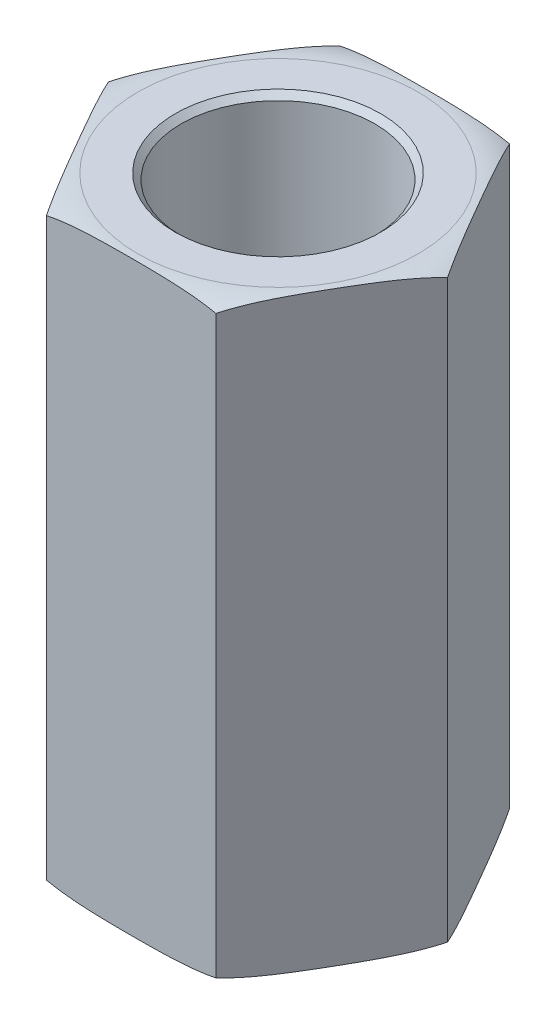
ISO-10303-21;
HEADER;
FILE_DESCRIPTION(('STEP AP214'),'2;1');
FILE_NAME('part.step','',(''),(''),'','','');
FILE_SCHEMA(('AUTOMOTIVE_DESIGN { 1 0 10303 214 1 1 1 1 }'));
ENDSEC;
DATA;
#1=APPLICATION_CONTEXT('core data for automotive mechanical design processes');
#2=APPLICATION_PROTOCOL_DEFINITION('international standard','automotive_design',2000,#1);
#3=PRODUCT_CONTEXT('',#1,'mechanical');
#4=PRODUCT('Part','Part','',(#3));
#5=PRODUCT_RELATED_PRODUCT_CATEGORY('part','',(#4));
#6=PRODUCT_DEFINITION_FORMATION('','',#4);
#7=PRODUCT_DEFINITION_CONTEXT('part definition',#1,'design');
#8=PRODUCT_DEFINITION('design','',#6,#7);
#9=PRODUCT_DEFINITION_SHAPE('','',#8);
#10=(LENGTH_UNIT() NAMED_UNIT(*) SI_UNIT(.MILLI.,.METRE.));
#11=(NAMED_UNIT(*) PLANE_ANGLE_UNIT() SI_UNIT($,.RADIAN.));
#12=(NAMED_UNIT(*) SI_UNIT($,.STERADIAN.) SOLID_ANGLE_UNIT());
#13=UNCERTAINTY_MEASURE_WITH_UNIT(LENGTH_MEASURE(1.E-05),#10,'distance_accuracy_value','');
#14=(GEOMETRIC_REPRESENTATION_CONTEXT(3) GLOBAL_UNCERTAINTY_ASSIGNED_CONTEXT((#13)) GLOBAL_UNIT_ASSIGNED_CONTEXT((#10,
#11,#12)) REPRESENTATION_CONTEXT('',''));
#15=CARTESIAN_POINT('',(0.,0.,0.));
#16=DIRECTION('',(0.,0.,1.));
#17=DIRECTION('',(1.,0.,0.));
#18=AXIS2_PLACEMENT_3D('',#15,#16,#17);
#19=CARTESIAN_POINT('',(3.66617420935412,6.35,0.));
#20=DIRECTION('',(-0.866025403784439,0.,0.5));
#21=DIRECTION('',(0.5,0.,0.866025403784439));
#22=AXIS2_PLACEMENT_3D('',#19,#20,#21);
#23=PLANE('',#22);
#24=CARTESIAN_POINT('',(3.66617420935412,6.223,0.));
#25=CARTESIAN_POINT('',(3.63753042799203,6.23493202468709,-0.0496124846400273));
#26=CARTESIAN_POINT('',(3.60875945805375,6.24555614694223,-0.0994452663561575));
#27=CARTESIAN_POINT('',(3.5510445941875,6.26452869380446,-0.199410342924434));
#28=CARTESIAN_POINT('',(3.52210079717004,6.27287829008084,-0.249542469922636));
#29=CARTESIAN_POINT('',(3.43520914920621,6.29501015084215,-0.400043218949385));
#30=CARTESIAN_POINT('',(3.37708055050429,6.30592253839952,-0.500724905273883));
#31=CARTESIAN_POINT('',(3.26070078255249,6.3225474670846,-0.70230057633948));
#32=CARTESIAN_POINT('',(3.20244972255356,6.32826351393611,-0.803194371852365));
#33=CARTESIAN_POINT('',(3.08586365366197,6.33654325238667,-1.00512736662734));
#34=CARTESIAN_POINT('',(3.02752861562773,6.3391051045623,-1.1061666163641));
#35=CARTESIAN_POINT('',(2.9113821383228,6.3424800878033,-1.30733821617637));
#36=CARTESIAN_POINT('',(2.85357078573452,6.34330898530758,-1.40747041611356));
#37=CARTESIAN_POINT('',(2.73795502274299,6.34390235146376,-1.60772279177073));
#38=CARTESIAN_POINT('',(2.68015061252641,6.34366697200316,-1.70784296716739));
#39=CARTESIAN_POINT('',(2.5645271384304,6.34193398748164,-1.90810869884931));
#40=CARTESIAN_POINT('',(2.50670807591217,6.34043597123025,-2.0082542527769));
#41=CARTESIAN_POINT('',(2.39109525560101,6.33517531674577,-2.20850153156215));
#42=CARTESIAN_POINT('',(2.33330149587797,6.33141290136093,-2.30860325976288));
#43=CARTESIAN_POINT('',(2.23849359853911,6.32198899303816,-2.47281535491257));
#44=CARTESIAN_POINT('',(2.20145192539195,6.31749057663767,-2.53697341480081));
#45=CARTESIAN_POINT('',(2.12747060706784,6.30630148199487,-2.66511281694908));
#46=CARTESIAN_POINT('',(2.09053091530161,6.2996120720916,-2.72909423990413));
#47=CARTESIAN_POINT('',(2.01669860633929,6.28339780386583,-2.85697555026699));
#48=CARTESIAN_POINT('',(1.97980639337021,6.27386525006224,-2.92087473753309));
#49=CARTESIAN_POINT('',(1.90623831426152,6.25126291445617,-3.04829838836459));
#50=CARTESIAN_POINT('',(1.86956287153406,6.23818767878213,-3.11182211855863));
#51=CARTESIAN_POINT('',(1.83308710467706,6.223,-3.175));
#52=B_SPLINE_CURVE_WITH_KNOTS('',3,(#24,#25,#26,#27,#28,#29,#30,#31,#32,#33,#34,#35,#36,#37,#38,
#39,#40,#41,#42,#43,#44,#45,#46,#47,#48,#49,#50,#51),.UNSPECIFIED.,.F.,.F.,(4,2,2,2,2,2,2,2,2,2,
2,2,2,4),(0.,0.17550946738822,0.350928353443244,0.701031261588485,1.05089779629355,
1.40096826525493,1.74783967758032,2.09466158796882,2.44159648808704,2.78849725058545,
3.01113198199941,3.23363806003512,3.45675194236245,3.68021127402553),.UNSPECIFIED.);
#53=CARTESIAN_POINT('',(3.66617420935412,6.223,0.));
#54=VERTEX_POINT('',#53);
#55=CARTESIAN_POINT('',(1.83308710467706,6.223,-3.175));
#56=VERTEX_POINT('',#55);
#57=EDGE_CURVE('E106',#54,#56,#52,.T.);
#58=ORIENTED_EDGE('',*,*,#57,.F.);
#59=DIRECTION('',(0.,1.,0.));
#60=VECTOR('',#59,1.);
#61=CARTESIAN_POINT('',(3.66617420935412,6.35,0.));
#62=LINE('',#61,#60);
#63=CARTESIAN_POINT('',(3.66617420935412,-6.223,0.));
#64=VERTEX_POINT('',#63);
#65=EDGE_CURVE('E79',#54,#64,#62,.F.);
#66=ORIENTED_EDGE('',*,*,#65,.T.);
#67=CARTESIAN_POINT('',(1.83308710467705,-6.223,-3.17500000000001));
#68=CARTESIAN_POINT('',(1.86173088603914,-6.23493202468708,-3.12538751535998));
#69=CARTESIAN_POINT('',(1.89050185597742,-6.24555614694223,-3.07555473364384));
#70=CARTESIAN_POINT('',(1.94821671984368,-6.26452869380445,-2.97558965707556));
#71=CARTESIAN_POINT('',(1.97716051686114,-6.27287829008084,-2.92545753007736));
#72=CARTESIAN_POINT('',(2.06405216482497,-6.29501015084215,-2.77495678105061));
#73=CARTESIAN_POINT('',(2.12218076352689,-6.30592253839952,-2.67427509472611));
#74=CARTESIAN_POINT('',(2.2385605314787,-6.3225474670846,-2.4726994236605));
#75=CARTESIAN_POINT('',(2.29681159147762,-6.32826351393611,-2.37180562814761));
#76=CARTESIAN_POINT('',(2.41339766036922,-6.33654325238667,-2.16987263337264));
#77=CARTESIAN_POINT('',(2.47173269840347,-6.3391051045623,-2.06883338363586));
#78=CARTESIAN_POINT('',(2.58787917570839,-6.3424800878033,-1.86766178382359));
#79=CARTESIAN_POINT('',(2.64569052829668,-6.34330898530758,-1.7675295838864));
#80=CARTESIAN_POINT('',(2.76130629128821,-6.34390235146376,-1.56727720822922));
#81=CARTESIAN_POINT('',(2.81911070150479,-6.34366697200316,-1.46715703283255));
#82=CARTESIAN_POINT('',(2.93473417560081,-6.34193398748164,-1.26689130115063));
#83=CARTESIAN_POINT('',(2.99255323811904,-6.34043597123025,-1.16674574722304));
#84=CARTESIAN_POINT('',(3.1081660584302,-6.33517531674576,-0.966498468437779));
#85=CARTESIAN_POINT('',(3.16595981815325,-6.33141290136092,-0.866396740237043));
#86=CARTESIAN_POINT('',(3.26076771549211,-6.32198899303815,-0.702184645087361));
#87=CARTESIAN_POINT('',(3.29780938863927,-6.31749057663767,-0.638026585199124));
#88=CARTESIAN_POINT('',(3.37179070696336,-6.30630148199486,-0.509887183050866));
#89=CARTESIAN_POINT('',(3.40873039872959,-6.2996120720916,-0.445905760095823));
#90=CARTESIAN_POINT('',(3.4825627076919,-6.28339780386583,-0.318024449732975));
#91=CARTESIAN_POINT('',(3.51945492066098,-6.27386525006224,-0.254125262466882));
#92=CARTESIAN_POINT('',(3.59302299976966,-6.25126291445617,-0.126701611635399));
#93=CARTESIAN_POINT('',(3.62969844249711,-6.23818767878213,-0.0631778814413663));
#94=CARTESIAN_POINT('',(3.66617420935412,-6.223,0.));
#95=B_SPLINE_CURVE_WITH_KNOTS('',3,(#67,#68,#69,#70,#71,#72,#73,#74,#75,#76,#77,#78,#79,#80,#81,
#82,#83,#84,#85,#86,#87,#88,#89,#90,#91,#92,#93,#94),.UNSPECIFIED.,.F.,.F.,(4,2,2,2,2,2,2,2,2,2,
2,2,2,4),(0.,0.175509467388227,0.350928353443257,0.701031261588509,1.05089779629358,
1.40096826525498,1.74783967758038,2.09466158796889,2.44159648808712,2.78849725058554,
3.01113198199948,3.23363806003517,3.45675194236248,3.68021127402553),.UNSPECIFIED.);
#96=CARTESIAN_POINT('',(1.83308710467705,-6.223,-3.175));
#97=VERTEX_POINT('',#96);
#98=EDGE_CURVE('E96',#97,#64,#95,.T.);
#99=ORIENTED_EDGE('',*,*,#98,.F.);
#100=DIRECTION('',(0.,1.,0.));
#101=VECTOR('',#100,1.);
#102=CARTESIAN_POINT('',(1.83308710467704,6.35,-3.175));
#103=LINE('',#102,#101);
#104=EDGE_CURVE('E110',#97,#56,#103,.T.);
#105=ORIENTED_EDGE('',*,*,#104,.T.);
#106=EDGE_LOOP('',(#58,#66,#99,#105));
#107=FACE_BOUND('',#106,.T.);
#108=ADVANCED_FACE('F16',(#107),#23,.F.);
#109=CARTESIAN_POINT('',(1.83308710467706,6.35,3.17499999999999));
#110=DIRECTION('',(-0.866025403784439,0.,-0.5));
#111=DIRECTION('',(-0.5,0.,0.866025403784439));
#112=AXIS2_PLACEMENT_3D('',#109,#110,#111);
#113=PLANE('',#112);
#114=CARTESIAN_POINT('',(1.83308710467706,6.223,3.17499999999999));
#115=CARTESIAN_POINT('',(1.86173088603915,6.23493202468709,3.12538751535996));
#116=CARTESIAN_POINT('',(1.89050185597743,6.24555614694223,3.07555473364383));
#117=CARTESIAN_POINT('',(1.94821671984368,6.26452869380446,2.97558965707556));
#118=CARTESIAN_POINT('',(1.97716051686114,6.27287829008084,2.92545753007736));
#119=CARTESIAN_POINT('',(2.06405216482498,6.29501015084215,2.77495678105061));
#120=CARTESIAN_POINT('',(2.12218076352689,6.30592253839952,2.67427509472611));
#121=CARTESIAN_POINT('',(2.23856053147869,6.3225474670846,2.47269942366051));
#122=CARTESIAN_POINT('',(2.29681159147762,6.32826351393611,2.37180562814763));
#123=CARTESIAN_POINT('',(2.41339766036922,6.33654325238667,2.16987263337266));
#124=CARTESIAN_POINT('',(2.47173269840346,6.3391051045623,2.06883338363589));
#125=CARTESIAN_POINT('',(2.58787917570838,6.3424800878033,1.86766178382362));
#126=CARTESIAN_POINT('',(2.64569052829666,6.34330898530758,1.76752958388643));
#127=CARTESIAN_POINT('',(2.76130629128819,6.34390235146376,1.56727720822926));
#128=CARTESIAN_POINT('',(2.81911070150477,6.34366697200316,1.46715703283259));
#129=CARTESIAN_POINT('',(2.93473417560078,6.34193398748164,1.26689130115068));
#130=CARTESIAN_POINT('',(2.99255323811902,6.34043597123025,1.16674574722309));
#131=CARTESIAN_POINT('',(3.10816605843017,6.33517531674577,0.966498468437838));
#132=CARTESIAN_POINT('',(3.16595981815321,6.33141290136093,0.866396740237105));
#133=CARTESIAN_POINT('',(3.26076771549208,6.32198899303816,0.702184645087422));
#134=CARTESIAN_POINT('',(3.29780938863924,6.31749057663767,0.638026585199181));
#135=CARTESIAN_POINT('',(3.37179070696334,6.30630148199487,0.509887183050912));
#136=CARTESIAN_POINT('',(3.40873039872957,6.2996120720916,0.445905760095864));
#137=CARTESIAN_POINT('',(3.48256270769189,6.28339780386583,0.318024449733006));
#138=CARTESIAN_POINT('',(3.51945492066097,6.27386525006224,0.254125262466908));
#139=CARTESIAN_POINT('',(3.59302299976965,6.25126291445617,0.126701611635414));
#140=CARTESIAN_POINT('',(3.62969844249711,6.23818767878213,0.0631778814413764));
#141=CARTESIAN_POINT('',(3.66617420935412,6.223,0.));
#142=B_SPLINE_CURVE_WITH_KNOTS('',3,(#114,#115,#116,#117,#118,#119,#120,#121,#122,#123,#124,
#125,#126,#127,#128,#129,#130,#131,#132,#133,#134,#135,#136,#137,#138,#139,#140,#141),
.UNSPECIFIED.,.F.,.F.,(4,2,2,2,2,2,2,2,2,2,2,2,2,4),(0.,0.175509467388221,0.350928353443245,
0.701031261588486,1.05089779629355,1.40096826525493,1.74783967758032,2.09466158796882,
2.44159648808704,2.78849725058545,3.0111319819994,3.23363806003511,3.45675194236244,
3.68021127402551),.UNSPECIFIED.);
#143=CARTESIAN_POINT('',(1.83308710467706,6.223,3.17499999999999));
#144=VERTEX_POINT('',#143);
#145=EDGE_CURVE('E21',#144,#54,#142,.T.);
#146=ORIENTED_EDGE('',*,*,#145,.F.);
#147=DIRECTION('',(0.,1.,0.));
#148=VECTOR('',#147,1.);
#149=CARTESIAN_POINT('',(1.83308710467706,6.35,3.17499999999999));
#150=LINE('',#149,#148);
#151=CARTESIAN_POINT('',(1.83308710467706,-6.223,3.17499999999999));
#152=VERTEX_POINT('',#151);
#153=EDGE_CURVE('E99',#144,#152,#150,.F.);
#154=ORIENTED_EDGE('',*,*,#153,.T.);
#155=CARTESIAN_POINT('',(3.66617420935412,-6.223,0.));
#156=CARTESIAN_POINT('',(3.63753042799203,-6.23493202468709,0.0496124846400355));
#157=CARTESIAN_POINT('',(3.60875945805375,-6.24555614694223,0.0994452663561683));
#158=CARTESIAN_POINT('',(3.55104459418749,-6.26452869380446,0.19941034292445));
#159=CARTESIAN_POINT('',(3.52210079717003,-6.27287829008084,0.249542469922655));
#160=CARTESIAN_POINT('',(3.43520914920619,-6.29501015084215,0.400043218949413));
#161=CARTESIAN_POINT('',(3.37708055050427,-6.30592253839952,0.500724905273916));
#162=CARTESIAN_POINT('',(3.26070078255247,-6.3225474670846,0.702300576339523));
#163=CARTESIAN_POINT('',(3.20244972255354,-6.32826351393611,0.803194371852414));
#164=CARTESIAN_POINT('',(3.08586365366193,-6.33654325238667,1.0051273666274));
#165=CARTESIAN_POINT('',(3.02752861562769,-6.3391051045623,1.10616661636417));
#166=CARTESIAN_POINT('',(2.91138213832276,-6.3424800878033,1.30733821617645));
#167=CARTESIAN_POINT('',(2.85357078573448,-6.34330898530758,1.40747041611364));
#168=CARTESIAN_POINT('',(2.73795502274294,-6.34390235146376,1.60772279177082));
#169=CARTESIAN_POINT('',(2.68015061252636,-6.34366697200316,1.70784296716749));
#170=CARTESIAN_POINT('',(2.56452713843034,-6.34193398748164,1.90810869884942));
#171=CARTESIAN_POINT('',(2.5067080759121,-6.34043597123025,2.00825425277701));
#172=CARTESIAN_POINT('',(2.39109525560094,-6.33517531674576,2.20850153156228));
#173=CARTESIAN_POINT('',(2.3333014958779,-6.33141290136092,2.30860325976302));
#174=CARTESIAN_POINT('',(2.23849359853904,-6.32198899303815,2.47281535491269));
#175=CARTESIAN_POINT('',(2.20145192539188,-6.31749057663766,2.53697341480092));
#176=CARTESIAN_POINT('',(2.1274706070678,-6.30630148199486,2.66511281694917));
#177=CARTESIAN_POINT('',(2.09053091530157,-6.29961207209159,2.72909423990421));
#178=CARTESIAN_POINT('',(2.01669860633926,-6.28339780386582,2.85697555026704));
#179=CARTESIAN_POINT('',(1.97980639337019,-6.27386525006223,2.92087473753313));
#180=CARTESIAN_POINT('',(1.90623831426151,-6.25126291445617,3.0482983883646));
#181=CARTESIAN_POINT('',(1.86956287153406,-6.23818767878213,3.11182211855863));
#182=CARTESIAN_POINT('',(1.83308710467706,-6.223,3.17499999999999));
#183=B_SPLINE_CURVE_WITH_KNOTS('',3,(#155,#156,#157,#158,#159,#160,#161,#162,#163,#164,#165,
#166,#167,#168,#169,#170,#171,#172,#173,#174,#175,#176,#177,#178,#179,#180,#181,#182),
.UNSPECIFIED.,.F.,.F.,(4,2,2,2,2,2,2,2,2,2,2,2,2,4),(0.,0.17550946738823,0.350928353443263,
0.701031261588523,1.0508977962936,1.40096826525501,1.74783967758041,2.09466158796894,
2.44159648808717,2.7884972505856,3.01113198199951,3.23363806003518,3.45675194236248,
3.68021127402551),.UNSPECIFIED.);
#184=EDGE_CURVE('E204',#64,#152,#183,.T.);
#185=ORIENTED_EDGE('',*,*,#184,.F.);
#186=ORIENTED_EDGE('',*,*,#65,.F.);
#187=EDGE_LOOP('',(#146,#154,#185,#186));
#188=FACE_BOUND('',#187,.T.);
#189=ADVANCED_FACE('F105',(#188),#113,.F.);
#190=CARTESIAN_POINT('',(-1.83308710467707,6.35,3.175));
#191=DIRECTION('',(0.,0.,-1.));
#192=DIRECTION('',(-1.,0.,0.));
#193=AXIS2_PLACEMENT_3D('',#190,#191,#192);
#194=PLANE('',#193);
#195=ORIENTED_EDGE('',*,*,#153,.F.);
#196=CARTESIAN_POINT('',(-1.83308710467707,6.223,3.175));
#197=CARTESIAN_POINT('',(-1.75760871054776,6.23871230122365,3.175));
#198=CARTESIAN_POINT('',(-1.68170571468658,6.2521647800808,3.175));
#199=CARTESIAN_POINT('',(-1.52939807527773,6.27530486470105,3.175));
#200=CARTESIAN_POINT('',(-1.45299400110163,6.28499617502722,3.175));
#201=CARTESIAN_POINT('',(-1.30011823209763,6.30137135267138,3.175));
#202=CARTESIAN_POINT('',(-1.22364747610196,6.30806442247852,3.175));
#203=CARTESIAN_POINT('',(-1.07052459410173,6.31917241699752,3.175));
#204=CARTESIAN_POINT('',(-0.993872424115957,6.32358671655425,3.175));
#205=CARTESIAN_POINT('',(-0.840856910195846,6.33072419802798,3.175));
#206=CARTESIAN_POINT('',(-0.764493913329282,6.33345527367792,3.175));
#207=CARTESIAN_POINT('',(-0.611734616938516,6.33775632258003,3.175));
#208=CARTESIAN_POINT('',(-0.535338316331409,6.33932625473883,3.175));
#209=CARTESIAN_POINT('',(-0.38245423122642,6.34168247076567,3.175));
#210=CARTESIAN_POINT('',(-0.305966435115039,6.34246792759644,3.175));
#211=CARTESIAN_POINT('',(-0.152985759387013,6.34348841069004,3.175));
#212=CARTESIAN_POINT('',(-0.0764928796935063,6.3437234241492,3.175));
#213=CARTESIAN_POINT('',(0.0764928796935061,6.3437234241492,3.175));
#214=CARTESIAN_POINT('',(0.152985759387012,6.34348841069004,3.17499999999999));
#215=CARTESIAN_POINT('',(0.305966435115038,6.34246792759644,3.17499999999999));
#216=CARTESIAN_POINT('',(0.382454231226419,6.34168247076567,3.17499999999999));
#217=CARTESIAN_POINT('',(0.535338316331408,6.33932625473883,3.17499999999999));
#218=CARTESIAN_POINT('',(0.611734616938515,6.33775632258003,3.17499999999999));
#219=CARTESIAN_POINT('',(0.76449391332928,6.33345527367792,3.17499999999999));
#220=CARTESIAN_POINT('',(0.840856910195844,6.33072419802798,3.17499999999999));
#221=CARTESIAN_POINT('',(0.993872424115954,6.32358671655425,3.17499999999999));
#222=CARTESIAN_POINT('',(1.07052459410172,6.31917241699752,3.17499999999999));
#223=CARTESIAN_POINT('',(1.22364747610196,6.30806442247852,3.17499999999999));
#224=CARTESIAN_POINT('',(1.30011823209763,6.30137135267139,3.17499999999999));
#225=CARTESIAN_POINT('',(1.45299400110163,6.28499617502722,3.17499999999999));
#226=CARTESIAN_POINT('',(1.52939807527773,6.27530486470105,3.17499999999999));
#227=CARTESIAN_POINT('',(1.68170571468658,6.25216478008081,3.17499999999999));
#228=CARTESIAN_POINT('',(1.75760871054776,6.23871230122365,3.17499999999999));
#229=CARTESIAN_POINT('',(1.83308710467706,6.223,3.17499999999999));
#230=B_SPLINE_CURVE_WITH_KNOTS('',3,(#196,#197,#198,#199,#200,#201,#202,#203,#204,#205,#206,
#207,#208,#209,#210,#211,#212,#213,#214,#215,#216,#217,#218,#219,#220,#221,#222,#223,#224,#225,
#226,#227,#228,#229),.UNSPECIFIED.,.F.,.F.,(4,2,2,2,2,2,2,2,2,2,2,2,2,2,2,2,4),(0.,
0.23119079437731,0.46215329593589,0.692401964780505,0.922713766248053,1.15193709952408,
1.3811685447265,1.61064140410055,1.84011960111017,2.06959779811978,2.29907065749383,
2.52830210269625,2.75752543597228,2.98783723743982,3.21808590628444,3.44904840784302,
3.68023920222033),.UNSPECIFIED.);
#231=CARTESIAN_POINT('',(-1.83308710467707,6.223,3.175));
#232=VERTEX_POINT('',#231);
#233=EDGE_CURVE('E85',#232,#144,#230,.T.);
#234=ORIENTED_EDGE('',*,*,#233,.F.);
#235=DIRECTION('',(0.,1.,0.));
#236=VECTOR('',#235,1.);
#237=CARTESIAN_POINT('',(-1.83308710467707,6.35,3.175));
#238=LINE('',#237,#236);
#239=CARTESIAN_POINT('',(-1.83308710467707,-6.223,3.175));
#240=VERTEX_POINT('',#239);
#241=EDGE_CURVE('E103',#232,#240,#238,.F.);
#242=ORIENTED_EDGE('',*,*,#241,.T.);
#243=CARTESIAN_POINT('',(1.83308710467706,-6.223,3.17499999999999));
#244=CARTESIAN_POINT('',(1.75760871054776,-6.23871230122365,3.17499999999999));
#245=CARTESIAN_POINT('',(1.68170571468658,-6.25216478008081,3.17499999999999));
#246=CARTESIAN_POINT('',(1.52939807527773,-6.27530486470105,3.17499999999999));
#247=CARTESIAN_POINT('',(1.45299400110163,-6.28499617502722,3.17499999999999));
#248=CARTESIAN_POINT('',(1.30011823209763,-6.30137135267139,3.17499999999999));
#249=CARTESIAN_POINT('',(1.22364747610196,-6.30806442247852,3.17499999999999));
#250=CARTESIAN_POINT('',(1.07052459410172,-6.31917241699752,3.17499999999999));
#251=CARTESIAN_POINT('',(0.993872424115954,-6.32358671655425,3.17499999999999));
#252=CARTESIAN_POINT('',(0.840856910195844,-6.33072419802799,3.17499999999999));
#253=CARTESIAN_POINT('',(0.76449391332928,-6.33345527367792,3.17499999999999));
#254=CARTESIAN_POINT('',(0.611734616938515,-6.33775632258003,3.17499999999999));
#255=CARTESIAN_POINT('',(0.535338316331408,-6.33932625473883,3.17499999999999));
#256=CARTESIAN_POINT('',(0.382454231226419,-6.34168247076568,3.17499999999999));
#257=CARTESIAN_POINT('',(0.305966435115038,-6.34246792759644,3.17499999999999));
#258=CARTESIAN_POINT('',(0.152985759387012,-6.34348841069004,3.17499999999999));
#259=CARTESIAN_POINT('',(0.0764928796935062,-6.3437234241492,3.175));
#260=CARTESIAN_POINT('',(-0.076492879693506,-6.3437234241492,3.175));
#261=CARTESIAN_POINT('',(-0.152985759387012,-6.34348841069004,3.175));
#262=CARTESIAN_POINT('',(-0.305966435115038,-6.34246792759644,3.175));
#263=CARTESIAN_POINT('',(-0.382454231226419,-6.34168247076568,3.175));
#264=CARTESIAN_POINT('',(-0.535338316331408,-6.33932625473883,3.175));
#265=CARTESIAN_POINT('',(-0.611734616938515,-6.33775632258003,3.175));
#266=CARTESIAN_POINT('',(-0.76449391332928,-6.33345527367792,3.175));
#267=CARTESIAN_POINT('',(-0.840856910195844,-6.33072419802798,3.175));
#268=CARTESIAN_POINT('',(-0.993872424115955,-6.32358671655425,3.175));
#269=CARTESIAN_POINT('',(-1.07052459410172,-6.31917241699752,3.175));
#270=CARTESIAN_POINT('',(-1.22364747610196,-6.30806442247852,3.175));
#271=CARTESIAN_POINT('',(-1.30011823209763,-6.30137135267139,3.175));
#272=CARTESIAN_POINT('',(-1.45299400110163,-6.28499617502722,3.175));
#273=CARTESIAN_POINT('',(-1.52939807527773,-6.27530486470105,3.175));
#274=CARTESIAN_POINT('',(-1.68170571468658,-6.2521647800808,3.175));
#275=CARTESIAN_POINT('',(-1.75760871054776,-6.23871230122365,3.175));
#276=CARTESIAN_POINT('',(-1.83308710467706,-6.223,3.175));
#277=B_SPLINE_CURVE_WITH_KNOTS('',3,(#243,#244,#245,#246,#247,#248,#249,#250,#251,#252,#253,
#254,#255,#256,#257,#258,#259,#260,#261,#262,#263,#264,#265,#266,#267,#268,#269,#270,#271,#272,
#273,#274,#275,#276),.UNSPECIFIED.,.F.,.F.,(4,2,2,2,2,2,2,2,2,2,2,2,2,2,2,2,4),(0.,
0.23119079437731,0.462153295935889,0.692401964780502,0.92271376624805,1.15193709952407,
1.3811685447265,1.61064140410055,1.84011960111016,2.06959779811977,2.29907065749383,
2.52830210269625,2.75752543597227,2.98783723743982,3.21808590628443,3.44904840784301,
3.68023920222032),.UNSPECIFIED.);
#278=EDGE_CURVE('E101',#152,#240,#277,.T.);
#279=ORIENTED_EDGE('',*,*,#278,.F.);
#280=EDGE_LOOP('',(#195,#234,#242,#279));
#281=FACE_BOUND('',#280,.T.);
#282=ADVANCED_FACE('F100',(#281),#194,.F.);
#283=CARTESIAN_POINT('',(-3.66617420935413,6.35,0.));
#284=DIRECTION('',(0.866025403784439,0.,-0.499999999999999));
#285=DIRECTION('',(-0.499999999999999,0.,-0.866025403784439));
#286=AXIS2_PLACEMENT_3D('',#283,#284,#285);
#287=PLANE('',#286);
#288=CARTESIAN_POINT('',(-3.66617420935412,6.223,0.));
#289=CARTESIAN_POINT('',(-3.63753042799204,6.23493202468708,0.0496124846400287));
#290=CARTESIAN_POINT('',(-3.60875945805376,6.24555614694223,0.0994452663561603));
#291=CARTESIAN_POINT('',(-3.5510445941875,6.26452869380446,0.199410342924439));
#292=CARTESIAN_POINT('',(-3.52210079717004,6.27287829008084,0.249542469922643));
#293=CARTESIAN_POINT('',(-3.43520914920621,6.29501015084215,0.400043218949397));
#294=CARTESIAN_POINT('',(-3.37708055050429,6.30592253839952,0.500724905273897));
#295=CARTESIAN_POINT('',(-3.26070078255249,6.3225474670846,0.702300576339499));
#296=CARTESIAN_POINT('',(-3.20244972255356,6.32826351393611,0.803194371852387));
#297=CARTESIAN_POINT('',(-3.08586365366196,6.33654325238667,1.00512736662736));
#298=CARTESIAN_POINT('',(-3.02752861562771,6.3391051045623,1.10616661636413));
#299=CARTESIAN_POINT('',(-2.91138213832279,6.3424800878033,1.30733821617641));
#300=CARTESIAN_POINT('',(-2.85357078573451,6.34330898530758,1.4074704161136));
#301=CARTESIAN_POINT('',(-2.73795502274297,6.34390235146376,1.60772279177078));
#302=CARTESIAN_POINT('',(-2.68015061252639,6.34366697200316,1.70784296716744));
#303=CARTESIAN_POINT('',(-2.56452713843038,6.34193398748164,1.90810869884937));
#304=CARTESIAN_POINT('',(-2.50670807591214,6.34043597123025,2.00825425277695));
#305=CARTESIAN_POINT('',(-2.39109525560098,6.33517531674576,2.20850153156221));
#306=CARTESIAN_POINT('',(-2.33330149587794,6.33141290136092,2.30860325976295));
#307=CARTESIAN_POINT('',(-2.23849359853908,6.32198899303815,2.47281535491263));
#308=CARTESIAN_POINT('',(-2.20145192539192,6.31749057663767,2.53697341480087));
#309=CARTESIAN_POINT('',(-2.12747060706783,6.30630148199486,2.66511281694913));
#310=CARTESIAN_POINT('',(-2.0905309153016,6.2996120720916,2.72909423990417));
#311=CARTESIAN_POINT('',(-2.01669860633929,6.28339780386583,2.85697555026702));
#312=CARTESIAN_POINT('',(-1.97980639337021,6.27386525006224,2.92087473753311));
#313=CARTESIAN_POINT('',(-1.90623831426153,6.25126291445617,3.0482983883646));
#314=CARTESIAN_POINT('',(-1.86956287153407,6.23818767878213,3.11182211855863));
#315=CARTESIAN_POINT('',(-1.83308710467707,6.223,3.175));
#316=B_SPLINE_CURVE_WITH_KNOTS('',3,(#288,#289,#290,#291,#292,#293,#294,#295,#296,#297,#298,
#299,#300,#301,#302,#303,#304,#305,#306,#307,#308,#309,#310,#311,#312,#313,#314,#315),
.UNSPECIFIED.,.F.,.F.,(4,2,2,2,2,2,2,2,2,2,2,2,2,4),(0.,0.175509467388225,0.350928353443254,
0.701031261588504,1.05089779629357,1.40096826525497,1.74783967758037,2.09466158796888,
2.44159648808711,2.78849725058552,3.01113198199946,3.23363806003515,3.45675194236247,
3.68021127402552),.UNSPECIFIED.);
#317=CARTESIAN_POINT('',(-3.66617420935413,6.223,0.));
#318=VERTEX_POINT('',#317);
#319=EDGE_CURVE('E93',#318,#232,#316,.T.);
#320=ORIENTED_EDGE('',*,*,#319,.F.);
#321=DIRECTION('',(0.,1.,0.));
#322=VECTOR('',#321,1.);
#323=CARTESIAN_POINT('',(-3.66617420935413,6.35,0.));
#324=LINE('',#323,#322);
#325=CARTESIAN_POINT('',(-3.66617420935413,-6.223,0.));
#326=VERTEX_POINT('',#325);
#327=EDGE_CURVE('E117',#318,#326,#324,.F.);
#328=ORIENTED_EDGE('',*,*,#327,.T.);
#329=CARTESIAN_POINT('',(-1.83308710467707,-6.223,3.175));
#330=CARTESIAN_POINT('',(-1.86173088603915,-6.23493202468708,3.12538751535997));
#331=CARTESIAN_POINT('',(-1.89050185597743,-6.24555614694223,3.07555473364384));
#332=CARTESIAN_POINT('',(-1.94821671984368,-6.26452869380445,2.97558965707557));
#333=CARTESIAN_POINT('',(-1.97716051686114,-6.27287829008083,2.92545753007737));
#334=CARTESIAN_POINT('',(-2.06405216482498,-6.29501015084215,2.77495678105062));
#335=CARTESIAN_POINT('',(-2.12218076352689,-6.30592253839952,2.67427509472613));
#336=CARTESIAN_POINT('',(-2.23856053147869,-6.3225474670846,2.47269942366053));
#337=CARTESIAN_POINT('',(-2.29681159147761,-6.32826351393611,2.37180562814765));
#338=CARTESIAN_POINT('',(-2.41339766036921,-6.33654325238667,2.16987263337269));
#339=CARTESIAN_POINT('',(-2.47173269840345,-6.3391051045623,2.06883338363592));
#340=CARTESIAN_POINT('',(-2.58787917570836,-6.3424800878033,1.86766178382365));
#341=CARTESIAN_POINT('',(-2.64569052829664,-6.34330898530758,1.76752958388647));
#342=CARTESIAN_POINT('',(-2.76130629128817,-6.34390235146376,1.5672772082293));
#343=CARTESIAN_POINT('',(-2.81911070150475,-6.34366697200316,1.46715703283264));
#344=CARTESIAN_POINT('',(-2.93473417560076,-6.34193398748164,1.26689130115073));
#345=CARTESIAN_POINT('',(-2.99255323811899,-6.34043597123025,1.16674574722315));
#346=CARTESIAN_POINT('',(-3.10816605843015,-6.33517531674577,0.966498468437894));
#347=CARTESIAN_POINT('',(-3.16595981815318,-6.33141290136093,0.866396740237163));
#348=CARTESIAN_POINT('',(-3.26076771549205,-6.32198899303816,0.702184645087477));
#349=CARTESIAN_POINT('',(-3.29780938863921,-6.31749057663768,0.63802658519923));
#350=CARTESIAN_POINT('',(-3.37179070696332,-6.30630148199487,0.509887183050951));
#351=CARTESIAN_POINT('',(-3.40873039872955,-6.29961207209161,0.445905760095898));
#352=CARTESIAN_POINT('',(-3.48256270769188,-6.28339780386583,0.318024449733029));
#353=CARTESIAN_POINT('',(-3.51945492066096,-6.27386525006224,0.254125262466926));
#354=CARTESIAN_POINT('',(-3.59302299976965,-6.25126291445617,0.126701611635421));
#355=CARTESIAN_POINT('',(-3.62969844249711,-6.23818767878213,0.0631778814413781));
#356=CARTESIAN_POINT('',(-3.66617420935412,-6.223,0.));
#357=B_SPLINE_CURVE_WITH_KNOTS('',3,(#329,#330,#331,#332,#333,#334,#335,#336,#337,#338,#339,
#340,#341,#342,#343,#344,#345,#346,#347,#348,#349,#350,#351,#352,#353,#354,#355,#356),
.UNSPECIFIED.,.F.,.F.,(4,2,2,2,2,2,2,2,2,2,2,2,2,4),(0.,0.175509467388216,0.350928353443237,
0.701031261588471,1.05089779629352,1.4009682652549,1.74783967758028,2.09466158796878,
2.44159648808698,2.78849725058539,3.01113198199936,3.23363806003508,3.45675194236244,
3.68021127402552),.UNSPECIFIED.);
#358=EDGE_CURVE('E195',#240,#326,#357,.T.);
#359=ORIENTED_EDGE('',*,*,#358,.F.);
#360=ORIENTED_EDGE('',*,*,#241,.F.);
#361=EDGE_LOOP('',(#320,#328,#359,#360));
#362=FACE_BOUND('',#361,.T.);
#363=ADVANCED_FACE('F189',(#362),#287,.F.);
#364=CARTESIAN_POINT('',(-1.83308710467707,6.35,-3.175));
#365=DIRECTION('',(0.866025403784439,0.,0.5));
#366=DIRECTION('',(0.5,0.,-0.866025403784439));
#367=AXIS2_PLACEMENT_3D('',#364,#365,#366);
#368=PLANE('',#367);
#369=CARTESIAN_POINT('',(-1.83308710467706,6.223,-3.17500000000001));
#370=CARTESIAN_POINT('',(-1.86173088603915,6.23493202468708,-3.12538751535998));
#371=CARTESIAN_POINT('',(-1.89050185597743,6.24555614694223,-3.07555473364385));
#372=CARTESIAN_POINT('',(-1.94821671984368,6.26452869380445,-2.97558965707557));
#373=CARTESIAN_POINT('',(-1.97716051686114,6.27287829008083,-2.92545753007737));
#374=CARTESIAN_POINT('',(-2.06405216482498,6.29501015084215,-2.77495678105062));
#375=CARTESIAN_POINT('',(-2.12218076352689,6.30592253839952,-2.67427509472612));
#376=CARTESIAN_POINT('',(-2.2385605314787,6.3225474670846,-2.47269942366052));
#377=CARTESIAN_POINT('',(-2.29681159147762,6.32826351393611,-2.37180562814763));
#378=CARTESIAN_POINT('',(-2.41339766036922,6.33654325238667,-2.16987263337266));
#379=CARTESIAN_POINT('',(-2.47173269840346,6.3391051045623,-2.06883338363589));
#380=CARTESIAN_POINT('',(-2.58787917570839,6.3424800878033,-1.86766178382362));
#381=CARTESIAN_POINT('',(-2.64569052829667,6.34330898530758,-1.76752958388643));
#382=CARTESIAN_POINT('',(-2.7613062912882,6.34390235146376,-1.56727720822926));
#383=CARTESIAN_POINT('',(-2.81911070150478,6.34366697200316,-1.46715703283259));
#384=CARTESIAN_POINT('',(-2.93473417560079,6.34193398748164,-1.26689130115067));
#385=CARTESIAN_POINT('',(-2.99255323811903,6.34043597123025,-1.16674574722309));
#386=CARTESIAN_POINT('',(-3.10816605843019,6.33517531674577,-0.966498468437829));
#387=CARTESIAN_POINT('',(-3.16595981815323,6.33141290136093,-0.866396740237095));
#388=CARTESIAN_POINT('',(-3.26076771549209,6.32198899303815,-0.702184645087411));
#389=CARTESIAN_POINT('',(-3.29780938863925,6.31749057663767,-0.63802658519917));
#390=CARTESIAN_POINT('',(-3.37179070696335,6.30630148199487,-0.509887183050903));
#391=CARTESIAN_POINT('',(-3.40873039872958,6.2996120720916,-0.445905760095856));
#392=CARTESIAN_POINT('',(-3.4825627076919,6.28339780386583,-0.318024449733));
#393=CARTESIAN_POINT('',(-3.51945492066098,6.27386525006224,-0.254125262466903));
#394=CARTESIAN_POINT('',(-3.59302299976966,6.25126291445617,-0.126701611635411));
#395=CARTESIAN_POINT('',(-3.62969844249712,6.23818767878213,-0.0631778814413743));
#396=CARTESIAN_POINT('',(-3.66617420935413,6.223,0.));
#397=B_SPLINE_CURVE_WITH_KNOTS('',3,(#369,#370,#371,#372,#373,#374,#375,#376,#377,#378,#379,
#380,#381,#382,#383,#384,#385,#386,#387,#388,#389,#390,#391,#392,#393,#394,#395,#396),
.UNSPECIFIED.,.F.,.F.,(4,2,2,2,2,2,2,2,2,2,2,2,2,4),(0.,0.175509467388222,0.350928353443249,
0.701031261588494,1.05089779629356,1.40096826525495,1.74783967758034,2.09466158796885,
2.44159648808707,2.78849725058548,3.01113198199943,3.23363806003514,3.45675194236247,
3.68021127402553),.UNSPECIFIED.);
#398=CARTESIAN_POINT('',(-1.83308710467706,6.223,-3.175));
#399=VERTEX_POINT('',#398);
#400=EDGE_CURVE('E165',#399,#318,#397,.T.);
#401=ORIENTED_EDGE('',*,*,#400,.F.);
#402=DIRECTION('',(0.,1.,0.));
#403=VECTOR('',#402,1.);
#404=CARTESIAN_POINT('',(-1.83308710467706,6.35,-3.175));
#405=LINE('',#404,#403);
#406=CARTESIAN_POINT('',(-1.83308710467707,-6.223,-3.175));
#407=VERTEX_POINT('',#406);
#408=EDGE_CURVE('E107',#399,#407,#405,.F.);
#409=ORIENTED_EDGE('',*,*,#408,.T.);
#410=CARTESIAN_POINT('',(-3.66617420935413,-6.223,0.));
#411=CARTESIAN_POINT('',(-3.63753042799204,-6.23493202468708,-0.049612484640031));
#412=CARTESIAN_POINT('',(-3.60875945805377,-6.24555614694223,-0.0994452663561602));
#413=CARTESIAN_POINT('',(-3.55104459418751,-6.26452869380445,-0.199410342924434));
#414=CARTESIAN_POINT('',(-3.52210079717005,-6.27287829008083,-0.249542469922636));
#415=CARTESIAN_POINT('',(-3.43520914920622,-6.29501015084215,-0.400043218949382));
#416=CARTESIAN_POINT('',(-3.37708055050431,-6.30592253839952,-0.500724905273878));
#417=CARTESIAN_POINT('',(-3.26070078255251,-6.3225474670846,-0.70230057633947));
#418=CARTESIAN_POINT('',(-3.20244972255358,-6.32826351393611,-0.803194371852353));
#419=CARTESIAN_POINT('',(-3.08586365366199,-6.33654325238667,-1.00512736662732));
#420=CARTESIAN_POINT('',(-3.02752861562775,-6.3391051045623,-1.10616661636409));
#421=CARTESIAN_POINT('',(-2.91138213832283,-6.3424800878033,-1.30733821617635));
#422=CARTESIAN_POINT('',(-2.85357078573455,-6.34330898530758,-1.40747041611353));
#423=CARTESIAN_POINT('',(-2.73795502274302,-6.34390235146376,-1.6077227917707));
#424=CARTESIAN_POINT('',(-2.68015061252644,-6.34366697200316,-1.70784296716737));
#425=CARTESIAN_POINT('',(-2.56452713843043,-6.34193398748164,-1.90810869884928));
#426=CARTESIAN_POINT('',(-2.5067080759122,-6.34043597123025,-2.00825425277686));
#427=CARTESIAN_POINT('',(-2.39109525560104,-6.33517531674577,-2.20850153156211));
#428=CARTESIAN_POINT('',(-2.333301495878,-6.33141290136093,-2.30860325976284));
#429=CARTESIAN_POINT('',(-2.23849359853914,-6.32198899303816,-2.47281535491253));
#430=CARTESIAN_POINT('',(-2.20145192539198,-6.31749057663768,-2.53697341480078));
#431=CARTESIAN_POINT('',(-2.12747060706787,-6.30630148199487,-2.66511281694906));
#432=CARTESIAN_POINT('',(-2.09053091530164,-6.29961207209161,-2.72909423990411));
#433=CARTESIAN_POINT('',(-2.01669860633931,-6.28339780386583,-2.85697555026698));
#434=CARTESIAN_POINT('',(-1.97980639337023,-6.27386525006224,-2.92087473753308));
#435=CARTESIAN_POINT('',(-1.90623831426154,-6.25126291445617,-3.04829838836458));
#436=CARTESIAN_POINT('',(-1.86956287153408,-6.23818767878213,-3.11182211855862));
#437=CARTESIAN_POINT('',(-1.83308710467707,-6.223,-3.175));
#438=B_SPLINE_CURVE_WITH_KNOTS('',3,(#410,#411,#412,#413,#414,#415,#416,#417,#418,#419,#420,
#421,#422,#423,#424,#425,#426,#427,#428,#429,#430,#431,#432,#433,#434,#435,#436,#437),
.UNSPECIFIED.,.F.,.F.,(4,2,2,2,2,2,2,2,2,2,2,2,2,4),(0.,0.175509467388217,0.350928353443238,
0.701031261588472,1.05089779629353,1.40096826525491,1.74783967758028,2.09466158796878,
2.44159648808699,2.78849725058539,3.01113198199936,3.23363806003509,3.45675194236244,
3.68021127402552),.UNSPECIFIED.);
#439=EDGE_CURVE('E141',#326,#407,#438,.T.);
#440=ORIENTED_EDGE('',*,*,#439,.F.);
#441=ORIENTED_EDGE('',*,*,#327,.F.);
#442=EDGE_LOOP('',(#401,#409,#440,#441));
#443=FACE_BOUND('',#442,.T.);
#444=ADVANCED_FACE('F151',(#443),#368,.F.);
#445=CARTESIAN_POINT('',(1.83308710467706,6.35,-3.175));
#446=DIRECTION('',(0.,0.,1.));
#447=DIRECTION('',(1.,0.,0.));
#448=AXIS2_PLACEMENT_3D('',#445,#446,#447);
#449=PLANE('',#448);
#450=CARTESIAN_POINT('',(1.83308710467706,6.223,-3.175));
#451=CARTESIAN_POINT('',(1.75760871054775,6.23871230122365,-3.175));
#452=CARTESIAN_POINT('',(1.68170571468657,6.2521647800808,-3.175));
#453=CARTESIAN_POINT('',(1.52939807527772,6.27530486470105,-3.175));
#454=CARTESIAN_POINT('',(1.45299400110162,6.28499617502722,-3.175));
#455=CARTESIAN_POINT('',(1.30011823209763,6.30137135267138,-3.175));
#456=CARTESIAN_POINT('',(1.22364747610195,6.30806442247852,-3.175));
#457=CARTESIAN_POINT('',(1.07052459410172,6.31917241699751,-3.175));
#458=CARTESIAN_POINT('',(0.99387242411595,6.32358671655425,-3.175));
#459=CARTESIAN_POINT('',(0.840856910195841,6.33072419802798,-3.175));
#460=CARTESIAN_POINT('',(0.764493913329277,6.33345527367791,-3.175));
#461=CARTESIAN_POINT('',(0.611734616938512,6.33775632258003,-3.175));
#462=CARTESIAN_POINT('',(0.535338316331406,6.33932625473883,-3.175));
#463=CARTESIAN_POINT('',(0.382454231226418,6.34168247076567,-3.175));
#464=CARTESIAN_POINT('',(0.305966435115037,6.34246792759644,-3.175));
#465=CARTESIAN_POINT('',(0.152985759387012,6.34348841069004,-3.175));
#466=CARTESIAN_POINT('',(0.0764928796935061,6.3437234241492,-3.175));
#467=CARTESIAN_POINT('',(-0.0764928796935053,6.3437234241492,-3.175));
#468=CARTESIAN_POINT('',(-0.152985759387011,6.34348841069004,-3.175));
#469=CARTESIAN_POINT('',(-0.305966435115036,6.34246792759644,-3.175));
#470=CARTESIAN_POINT('',(-0.382454231226417,6.34168247076567,-3.175));
#471=CARTESIAN_POINT('',(-0.535338316331405,6.33932625473883,-3.175));
#472=CARTESIAN_POINT('',(-0.611734616938511,6.33775632258003,-3.175));
#473=CARTESIAN_POINT('',(-0.764493913329276,6.33345527367791,-3.175));
#474=CARTESIAN_POINT('',(-0.84085691019584,6.33072419802798,-3.175));
#475=CARTESIAN_POINT('',(-0.99387242411595,6.32358671655425,-3.175));
#476=CARTESIAN_POINT('',(-1.07052459410172,6.31917241699751,-3.175));
#477=CARTESIAN_POINT('',(-1.22364747610195,6.30806442247852,-3.175));
#478=CARTESIAN_POINT('',(-1.30011823209763,6.30137135267138,-3.175));
#479=CARTESIAN_POINT('',(-1.45299400110163,6.28499617502722,-3.175));
#480=CARTESIAN_POINT('',(-1.52939807527772,6.27530486470105,-3.175));
#481=CARTESIAN_POINT('',(-1.68170571468657,6.2521647800808,-3.175));
#482=CARTESIAN_POINT('',(-1.75760871054775,6.23871230122365,-3.175));
#483=CARTESIAN_POINT('',(-1.83308710467706,6.223,-3.175));
#484=B_SPLINE_CURVE_WITH_KNOTS('',3,(#450,#451,#452,#453,#454,#455,#456,#457,#458,#459,#460,
#461,#462,#463,#464,#465,#466,#467,#468,#469,#470,#471,#472,#473,#474,#475,#476,#477,#478,#479,
#480,#481,#482,#483),.UNSPECIFIED.,.F.,.F.,(4,2,2,2,2,2,2,2,2,2,2,2,2,2,2,2,4),(0.,
0.231190794377309,0.462153295935887,0.6924019647805,0.922713766248047,1.15193709952407,
1.38116854472649,1.61064140410054,1.84011960111015,2.06959779811976,2.29907065749382,
2.52830210269624,2.75752543597226,2.98783723743981,3.21808590628442,3.449048407843,
3.68023920222031),.UNSPECIFIED.);
#485=EDGE_CURVE('E108',#56,#399,#484,.T.);
#486=ORIENTED_EDGE('',*,*,#485,.F.);
#487=ORIENTED_EDGE('',*,*,#104,.F.);
#488=CARTESIAN_POINT('',(-1.83308710467707,-6.22299999999999,-3.175));
#489=CARTESIAN_POINT('',(-1.75760871054776,-6.23871230122365,-3.175));
#490=CARTESIAN_POINT('',(-1.68170571468658,-6.2521647800808,-3.175));
#491=CARTESIAN_POINT('',(-1.52939807527773,-6.27530486470104,-3.175));
#492=CARTESIAN_POINT('',(-1.45299400110163,-6.28499617502722,-3.175));
#493=CARTESIAN_POINT('',(-1.30011823209763,-6.30137135267138,-3.175));
#494=CARTESIAN_POINT('',(-1.22364747610196,-6.30806442247852,-3.175));
#495=CARTESIAN_POINT('',(-1.07052459410173,-6.31917241699751,-3.175));
#496=CARTESIAN_POINT('',(-0.993872424115956,-6.32358671655425,-3.175));
#497=CARTESIAN_POINT('',(-0.840856910195845,-6.33072419802798,-3.175));
#498=CARTESIAN_POINT('',(-0.764493913329281,-6.33345527367792,-3.175));
#499=CARTESIAN_POINT('',(-0.611734616938516,-6.33775632258003,-3.175));
#500=CARTESIAN_POINT('',(-0.535338316331409,-6.33932625473883,-3.175));
#501=CARTESIAN_POINT('',(-0.38245423122642,-6.34168247076567,-3.175));
#502=CARTESIAN_POINT('',(-0.305966435115039,-6.34246792759644,-3.175));
#503=CARTESIAN_POINT('',(-0.152985759387013,-6.34348841069004,-3.175));
#504=CARTESIAN_POINT('',(-0.0764928796935066,-6.3437234241492,-3.175));
#505=CARTESIAN_POINT('',(0.0764928796935049,-6.3437234241492,-3.175));
#506=CARTESIAN_POINT('',(0.15298575938701,-6.34348841069004,-3.175));
#507=CARTESIAN_POINT('',(0.305966435115035,-6.34246792759644,-3.175));
#508=CARTESIAN_POINT('',(0.382454231226416,-6.34168247076567,-3.175));
#509=CARTESIAN_POINT('',(0.535338316331403,-6.33932625473883,-3.175));
#510=CARTESIAN_POINT('',(0.611734616938509,-6.33775632258003,-3.175));
#511=CARTESIAN_POINT('',(0.764493913329273,-6.33345527367792,-3.175));
#512=CARTESIAN_POINT('',(0.840856910195836,-6.33072419802798,-3.175));
#513=CARTESIAN_POINT('',(0.993872424115945,-6.32358671655425,-3.175));
#514=CARTESIAN_POINT('',(1.07052459410171,-6.31917241699752,-3.175));
#515=CARTESIAN_POINT('',(1.22364747610195,-6.30806442247852,-3.175));
#516=CARTESIAN_POINT('',(1.30011823209762,-6.30137135267138,-3.175));
#517=CARTESIAN_POINT('',(1.45299400110162,-6.28499617502722,-3.175));
#518=CARTESIAN_POINT('',(1.52939807527771,-6.27530486470105,-3.175));
#519=CARTESIAN_POINT('',(1.68170571468656,-6.25216478008081,-3.175));
#520=CARTESIAN_POINT('',(1.75760871054774,-6.23871230122365,-3.175));
#521=CARTESIAN_POINT('',(1.83308710467705,-6.223,-3.175));
#522=B_SPLINE_CURVE_WITH_KNOTS('',3,(#488,#489,#490,#491,#492,#493,#494,#495,#496,#497,#498,
#499,#500,#501,#502,#503,#504,#505,#506,#507,#508,#509,#510,#511,#512,#513,#514,#515,#516,#517,
#518,#519,#520,#521),.UNSPECIFIED.,.F.,.F.,(4,2,2,2,2,2,2,2,2,2,2,2,2,2,2,2,4),(0.,
0.23119079437731,0.46215329593589,0.692401964780504,0.922713766248052,1.15193709952407,
1.3811685447265,1.61064140410055,1.84011960111016,2.06959779811977,2.29907065749383,
2.52830210269625,2.75752543597227,2.98783723743981,3.21808590628442,3.449048407843,
3.68023920222031),.UNSPECIFIED.);
#523=EDGE_CURVE('E135',#407,#97,#522,.T.);
#524=ORIENTED_EDGE('',*,*,#523,.F.);
#525=ORIENTED_EDGE('',*,*,#408,.F.);
#526=EDGE_LOOP('',(#486,#487,#524,#525));
#527=FACE_BOUND('',#526,.T.);
#528=ADVANCED_FACE('F147',(#527),#449,.F.);
#529=CARTESIAN_POINT('',(0.,4.69899999999995,0.));
#530=DIRECTION('',(0.,1.,0.));
#531=DIRECTION('',(0.,0.,1.));
#532=AXIS2_PLACEMENT_3D('',#529,#530,#531);
#533=TOROIDAL_SURFACE('',#532,3.03117420935412,1.65100000000005);
#534=ORIENTED_EDGE('',*,*,#57,.T.);
#535=ORIENTED_EDGE('',*,*,#485,.T.);
#536=ORIENTED_EDGE('',*,*,#400,.T.);
#537=ORIENTED_EDGE('',*,*,#319,.T.);
#538=ORIENTED_EDGE('',*,*,#233,.T.);
#539=ORIENTED_EDGE('',*,*,#145,.T.);
#540=EDGE_LOOP('',(#534,#535,#536,#537,#538,#539));
#541=FACE_BOUND('',#540,.T.);
#542=CARTESIAN_POINT('',(0.,6.35,0.));
#543=DIRECTION('',(0.,1.,0.));
#544=DIRECTION('',(0.,0.,1.));
#545=AXIS2_PLACEMENT_3D('',#542,#543,#544);
#546=CIRCLE('',#545,3.03117420935412);
#547=CARTESIAN_POINT('',(0.,6.35,3.03117420935412));
#548=VERTEX_POINT('',#547);
#549=EDGE_CURVE('E132',#548,#548,#546,.F.);
#550=ORIENTED_EDGE('',*,*,#549,.T.);
#551=EDGE_LOOP('',(#550));
#552=FACE_BOUND('',#551,.T.);
#553=ADVANCED_FACE('F88',(#541,#552),#533,.T.);
#554=CARTESIAN_POINT('',(0.,-4.69899999999999,0.));
#555=DIRECTION('',(0.,-1.,0.));
#556=DIRECTION('',(0.,0.,-1.));
#557=AXIS2_PLACEMENT_3D('',#554,#555,#556);
#558=TOROIDAL_SURFACE('',#557,3.03117420935412,1.65100000000001);
#559=CARTESIAN_POINT('',(0.,-6.35,-3.03117420935412));
#560=CARTESIAN_POINT('',(0.578424743720693,-6.35,-3.03088455919606));
#561=CARTESIAN_POINT('',(1.11575919022366,-6.35,-2.81835031833962));
#562=CARTESIAN_POINT('',(1.69861585330176,-6.35,-2.58781047630709));
#563=CARTESIAN_POINT('',(2.14336383839209,-6.35,-2.14336383839205));
#564=CARTESIAN_POINT('',(2.58666814314654,-6.35,-1.70035990262072));
#565=CARTESIAN_POINT('',(2.81835031833963,-6.35,-1.11575919022362));
#566=CARTESIAN_POINT('',(3.0309784255278,-6.35,-0.579237367453916));
#567=CARTESIAN_POINT('',(3.03117420935412,-6.35,0.));
#568=CARTESIAN_POINT('',(3.03136930427548,-6.35,0.577199203712815));
#569=CARTESIAN_POINT('',(2.81835031833961,-6.35,1.11575919022367));
#570=CARTESIAN_POINT('',(2.58781047292779,-6.35,1.69861585668335));
#571=CARTESIAN_POINT('',(2.14336383839205,-6.35,2.14336383839208));
#572=CARTESIAN_POINT('',(1.70035990262036,-6.35,2.58666814314691));
#573=CARTESIAN_POINT('',(1.11575919022363,-6.35,2.81835031833962));
#574=CARTESIAN_POINT('',(0.579475106659534,-6.35,3.03088420748249));
#575=CARTESIAN_POINT('',(0.,-6.35,3.03117420935412));
#576=B_SPLINE_CURVE_WITH_KNOTS('',2,(#559,#560,#561,#562,#563,#564,#565,#566,#567,#568,#569,
#570,#571,#572,#573,#574,#575),.UNSPECIFIED.,.F.,.F.,(3,2,2,2,2,2,2,2,3),(0.,0.125,0.25,0.375,
0.5,0.625,0.75,0.875,1.),.UNSPECIFIED.);
#577=CARTESIAN_POINT('',(0.,-6.35,-3.03117420935412));
#578=VERTEX_POINT('',#577);
#579=CARTESIAN_POINT('',(0.,-6.35,3.03117420935412));
#580=VERTEX_POINT('',#579);
#581=EDGE_CURVE('E40',#578,#580,#576,.T.);
#582=ORIENTED_EDGE('',*,*,#581,.F.);
#583=CARTESIAN_POINT('',(0.,-6.35,3.03117420935412));
#584=CARTESIAN_POINT('',(-0.578424743720748,-6.35,3.03088455919583));
#585=CARTESIAN_POINT('',(-1.11575919022365,-6.35,2.81835031833962));
#586=CARTESIAN_POINT('',(-1.69861585329917,-6.35,2.58781047630835));
#587=CARTESIAN_POINT('',(-2.14336383839207,-6.35,2.14336383839206));
#588=CARTESIAN_POINT('',(-2.58666814314576,-6.35,1.70035990262283));
#589=CARTESIAN_POINT('',(-2.81835031833962,-6.35,1.11575919022364));
#590=CARTESIAN_POINT('',(-3.03097842552755,-6.35,0.579237367454385));
#591=CARTESIAN_POINT('',(-3.03117420935412,-6.35,0.));
#592=CARTESIAN_POINT('',(-3.03136930427572,-6.35,-0.577199203710298));
#593=CARTESIAN_POINT('',(-2.81835031833962,-6.35,-1.11575919022364));
#594=CARTESIAN_POINT('',(-2.58781047292967,-6.35,-1.69861585668067));
#595=CARTESIAN_POINT('',(-2.14336383839207,-6.35,-2.14336383839207));
#596=CARTESIAN_POINT('',(-1.70035990262195,-6.35,-2.58666814314612));
#597=CARTESIAN_POINT('',(-1.11575919022364,-6.35,-2.81835031833962));
#598=CARTESIAN_POINT('',(-0.579475106660494,-6.35,-3.03088420748225));
#599=CARTESIAN_POINT('',(0.,-6.35,-3.03117420935412));
#600=B_SPLINE_CURVE_WITH_KNOTS('',2,(#583,#584,#585,#586,#587,#588,#589,#590,#591,#592,#593,
#594,#595,#596,#597,#598,#599),.UNSPECIFIED.,.F.,.F.,(3,2,2,2,2,2,2,2,3),(0.,0.125,0.25,0.375,
0.5,0.625,0.75,0.875,1.),.UNSPECIFIED.);
#601=EDGE_CURVE('E131',#580,#578,#600,.T.);
#602=ORIENTED_EDGE('',*,*,#601,.F.);
#603=EDGE_LOOP('',(#582,#602));
#604=FACE_BOUND('',#603,.T.);
#605=ORIENTED_EDGE('',*,*,#439,.T.);
#606=ORIENTED_EDGE('',*,*,#523,.T.);
#607=ORIENTED_EDGE('',*,*,#98,.T.);
#608=ORIENTED_EDGE('',*,*,#184,.T.);
#609=ORIENTED_EDGE('',*,*,#278,.T.);
#610=ORIENTED_EDGE('',*,*,#358,.T.);
#611=EDGE_LOOP('',(#605,#606,#607,#608,#609,#610));
#612=FACE_BOUND('',#611,.T.);
#613=ADVANCED_FACE('F18',(#604,#612),#558,.T.);
#614=CARTESIAN_POINT('',(-1.83308710467707,6.35,-3.175));
#615=DIRECTION('',(0.,-1.,0.));
#616=DIRECTION('',(0.,0.,-1.));
#617=AXIS2_PLACEMENT_3D('',#614,#615,#616);
#618=PLANE('',#617);
#619=CARTESIAN_POINT('',(0.,6.34999999994079,0.));
#620=DIRECTION('',(0.,1.,0.));
#621=DIRECTION('',(0.,0.,1.));
#622=AXIS2_PLACEMENT_3D('',#619,#620,#621);
#623=CIRCLE('',#622,2.22249999990254);
#624=CARTESIAN_POINT('',(0.,6.34999999994079,2.22249999990254));
#625=VERTEX_POINT('',#624);
#626=EDGE_CURVE('E128',#625,#625,#623,.F.);
#627=ORIENTED_EDGE('',*,*,#626,.T.);
#628=EDGE_LOOP('',(#627));
#629=FACE_BOUND('',#628,.T.);
#630=ORIENTED_EDGE('',*,*,#549,.F.);
#631=EDGE_LOOP('',(#630));
#632=FACE_BOUND('',#631,.T.);
#633=ADVANCED_FACE('F153',(#629,#632),#618,.F.);
#634=CARTESIAN_POINT('',(-1.83308710467707,-6.35,-3.175));
#635=DIRECTION('',(0.,-1.,0.));
#636=DIRECTION('',(0.,0.,-1.));
#637=AXIS2_PLACEMENT_3D('',#634,#635,#636);
#638=PLANE('',#637);
#639=CARTESIAN_POINT('',(0.,-6.34999999994079,0.));
#640=DIRECTION('',(0.,-1.,0.));
#641=DIRECTION('',(0.,0.,-1.));
#642=AXIS2_PLACEMENT_3D('',#639,#640,#641);
#643=CIRCLE('',#642,2.22249999990254);
#644=CARTESIAN_POINT('',(0.,-6.34999999994079,-2.22249999990254));
#645=VERTEX_POINT('',#644);
#646=EDGE_CURVE('E125',#645,#645,#643,.F.);
#647=ORIENTED_EDGE('',*,*,#646,.T.);
#648=EDGE_LOOP('',(#647));
#649=FACE_BOUND('',#648,.T.);
#650=ORIENTED_EDGE('',*,*,#581,.T.);
#651=ORIENTED_EDGE('',*,*,#601,.T.);
#652=EDGE_LOOP('',(#650,#651));
#653=FACE_BOUND('',#652,.T.);
#654=ADVANCED_FACE('F236',(#649,#653),#638,.T.);
#655=CARTESIAN_POINT('',(0.,6.34999999988395,0.));
#656=DIRECTION('',(0.,1.,0.));
#657=DIRECTION('',(0.,0.,1.));
#658=AXIS2_PLACEMENT_3D('',#655,#656,#657);
#659=CONICAL_SURFACE('',#658,2.2224999998457,0.785398163397448);
#660=ORIENTED_EDGE('',*,*,#626,.F.);
#661=EDGE_LOOP('',(#660));
#662=FACE_BOUND('',#661,.T.);
#663=CARTESIAN_POINT('',(0.,6.223,0.));
#664=DIRECTION('',(0.,1.,0.));
#665=DIRECTION('',(0.,0.,1.));
#666=AXIS2_PLACEMENT_3D('',#663,#664,#665);
#667=CIRCLE('',#666,2.0955);
#668=CARTESIAN_POINT('',(0.,6.223,2.0955));
#669=VERTEX_POINT('',#668);
#670=EDGE_CURVE('E32',#669,#669,#667,.F.);
#671=ORIENTED_EDGE('',*,*,#670,.T.);
#672=EDGE_LOOP('',(#671));
#673=FACE_BOUND('',#672,.T.);
#674=ADVANCED_FACE('F229',(#662,#673),#659,.F.);
#675=CARTESIAN_POINT('',(0.,-6.34999999982711,0.));
#676=DIRECTION('',(0.,-1.,0.));
#677=DIRECTION('',(0.,0.,-1.));
#678=AXIS2_PLACEMENT_3D('',#675,#676,#677);
#679=CONICAL_SURFACE('',#678,2.22249999978885,0.785398163397448);
#680=CARTESIAN_POINT('',(0.,-6.223,0.));
#681=DIRECTION('',(0.,1.,0.));
#682=DIRECTION('',(0.,0.,1.));
#683=AXIS2_PLACEMENT_3D('',#680,#681,#682);
#684=CIRCLE('',#683,2.0955);
#685=CARTESIAN_POINT('',(0.,-6.223,2.0955));
#686=VERTEX_POINT('',#685);
#687=EDGE_CURVE('E11',#686,#686,#684,.T.);
#688=ORIENTED_EDGE('',*,*,#687,.T.);
#689=EDGE_LOOP('',(#688));
#690=FACE_BOUND('',#689,.T.);
#691=ORIENTED_EDGE('',*,*,#646,.F.);
#692=EDGE_LOOP('',(#691));
#693=FACE_BOUND('',#692,.T.);
#694=ADVANCED_FACE('F223',(#690,#693),#679,.F.);
#695=CARTESIAN_POINT('',(0.,-6.35,0.));
#696=DIRECTION('',(0.,1.,0.));
#697=DIRECTION('',(0.,0.,1.));
#698=AXIS2_PLACEMENT_3D('',#695,#696,#697);
#699=CYLINDRICAL_SURFACE('',#698,2.0955);
#700=ORIENTED_EDGE('',*,*,#670,.F.);
#701=EDGE_LOOP('',(#700));
#702=FACE_BOUND('',#701,.T.);
#703=ORIENTED_EDGE('',*,*,#687,.F.);
#704=EDGE_LOOP('',(#703));
#705=FACE_BOUND('',#704,.T.);
#706=ADVANCED_FACE('F221',(#702,#705),#699,.F.);
#707=CLOSED_SHELL('',(#108,#189,#282,#363,#444,#528,#553,#613,#633,#654,#674,#694,#706));
#708=MANIFOLD_SOLID_BREP('B1',#707);
#709=ADVANCED_BREP_SHAPE_REPRESENTATION('',(#18,#708),#14);
#710=SHAPE_DEFINITION_REPRESENTATION(#9,#709);
ENDSEC;
END-ISO-10303-21;
